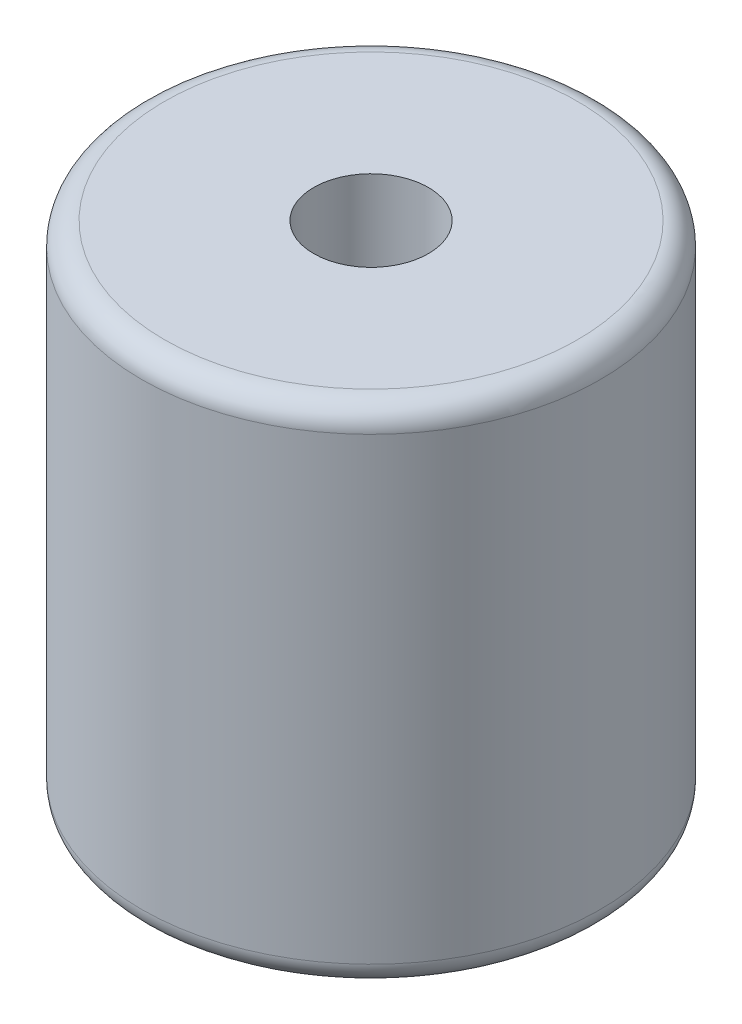
ISO-10303-21;
HEADER;
FILE_DESCRIPTION(('STEP AP214'),'2;1');
FILE_NAME('part.step','',(''),(''),'','','');
FILE_SCHEMA(('AUTOMOTIVE_DESIGN { 1 0 10303 214 1 1 1 1 }'));
ENDSEC;
DATA;
#1=APPLICATION_CONTEXT('core data for automotive mechanical design processes');
#2=APPLICATION_PROTOCOL_DEFINITION('international standard','automotive_design',2000,#1);
#3=PRODUCT_CONTEXT('',#1,'mechanical');
#4=PRODUCT('Part','Part','',(#3));
#5=PRODUCT_RELATED_PRODUCT_CATEGORY('part','',(#4));
#6=PRODUCT_DEFINITION_FORMATION('','',#4);
#7=PRODUCT_DEFINITION_CONTEXT('part definition',#1,'design');
#8=PRODUCT_DEFINITION('design','',#6,#7);
#9=PRODUCT_DEFINITION_SHAPE('','',#8);
#10=(LENGTH_UNIT() NAMED_UNIT(*) SI_UNIT(.MILLI.,.METRE.));
#11=(NAMED_UNIT(*) PLANE_ANGLE_UNIT() SI_UNIT($,.RADIAN.));
#12=(NAMED_UNIT(*) SI_UNIT($,.STERADIAN.) SOLID_ANGLE_UNIT());
#13=UNCERTAINTY_MEASURE_WITH_UNIT(LENGTH_MEASURE(1.E-05),#10,'distance_accuracy_value','');
#14=(GEOMETRIC_REPRESENTATION_CONTEXT(3) GLOBAL_UNCERTAINTY_ASSIGNED_CONTEXT((#13)) GLOBAL_UNIT_ASSIGNED_CONTEXT((#10,
#11,#12)) REPRESENTATION_CONTEXT('',''));
#15=CARTESIAN_POINT('',(0.,0.,0.));
#16=DIRECTION('',(0.,0.,1.));
#17=DIRECTION('',(1.,0.,0.));
#18=AXIS2_PLACEMENT_3D('',#15,#16,#17);
#19=CARTESIAN_POINT('',(0.,-21.,0.));
#20=DIRECTION('',(0.,1.,0.));
#21=DIRECTION('',(0.,0.,1.));
#22=AXIS2_PLACEMENT_3D('',#19,#20,#21);
#23=TOROIDAL_SURFACE('',#22,7.,0.999999999999999);
#24=CARTESIAN_POINT('',(0.,-21.,0.));
#25=DIRECTION('',(0.,1.,0.));
#26=DIRECTION('',(0.,0.,1.));
#27=AXIS2_PLACEMENT_3D('',#24,#25,#26);
#28=CIRCLE('',#27,6.);
#29=CARTESIAN_POINT('',(0.,-21.,6.));
#30=VERTEX_POINT('',#29);
#31=EDGE_CURVE('E10',#30,#30,#28,.T.);
#32=ORIENTED_EDGE('',*,*,#31,.T.);
#33=EDGE_LOOP('',(#32));
#34=FACE_BOUND('',#33,.T.);
#35=CARTESIAN_POINT('',(0.,-22.,0.));
#36=DIRECTION('',(0.,1.,0.));
#37=DIRECTION('',(0.,0.,1.));
#38=AXIS2_PLACEMENT_3D('',#35,#36,#37);
#39=CIRCLE('',#38,7.);
#40=CARTESIAN_POINT('',(0.,-22.,7.));
#41=VERTEX_POINT('',#40);
#42=EDGE_CURVE('E65',#41,#41,#39,.T.);
#43=ORIENTED_EDGE('',*,*,#42,.F.);
#44=EDGE_LOOP('',(#43));
#45=FACE_BOUND('',#44,.T.);
#46=ADVANCED_FACE('F34',(#34,#45),#23,.T.);
#47=CARTESIAN_POINT('',(0.,-22.,0.));
#48=DIRECTION('',(0.,1.,0.));
#49=DIRECTION('',(0.,0.,1.));
#50=AXIS2_PLACEMENT_3D('',#47,#48,#49);
#51=CYLINDRICAL_SURFACE('',#50,6.);
#52=CARTESIAN_POINT('',(0.,-5.,0.));
#53=DIRECTION('',(0.,1.,0.));
#54=DIRECTION('',(0.,0.,1.));
#55=AXIS2_PLACEMENT_3D('',#52,#53,#54);
#56=CIRCLE('',#55,6.);
#57=CARTESIAN_POINT('',(0.,-5.,6.));
#58=VERTEX_POINT('',#57);
#59=EDGE_CURVE('E40',#58,#58,#56,.T.);
#60=ORIENTED_EDGE('',*,*,#59,.T.);
#61=EDGE_LOOP('',(#60));
#62=FACE_BOUND('',#61,.T.);
#63=ORIENTED_EDGE('',*,*,#31,.F.);
#64=EDGE_LOOP('',(#63));
#65=FACE_BOUND('',#64,.T.);
#66=ADVANCED_FACE('F73',(#62,#65),#51,.F.);
#67=CARTESIAN_POINT('',(6.,-5.,0.));
#68=DIRECTION('',(0.,-1.,0.));
#69=DIRECTION('',(0.,0.,-1.));
#70=AXIS2_PLACEMENT_3D('',#67,#68,#69);
#71=PLANE('',#70);
#72=CARTESIAN_POINT('',(0.,-5.,0.));
#73=DIRECTION('',(0.,1.,0.));
#74=DIRECTION('',(0.,0.,1.));
#75=AXIS2_PLACEMENT_3D('',#72,#73,#74);
#76=CIRCLE('',#75,2.5);
#77=CARTESIAN_POINT('',(0.,-5.,2.5));
#78=VERTEX_POINT('',#77);
#79=EDGE_CURVE('E44',#78,#78,#76,.T.);
#80=ORIENTED_EDGE('',*,*,#79,.T.);
#81=EDGE_LOOP('',(#80));
#82=FACE_BOUND('',#81,.T.);
#83=ORIENTED_EDGE('',*,*,#59,.F.);
#84=EDGE_LOOP('',(#83));
#85=FACE_BOUND('',#84,.T.);
#86=ADVANCED_FACE('F77',(#82,#85),#71,.T.);
#87=CARTESIAN_POINT('',(0.,-22.,0.));
#88=DIRECTION('',(0.,1.,0.));
#89=DIRECTION('',(0.,0.,1.));
#90=AXIS2_PLACEMENT_3D('',#87,#88,#89);
#91=CYLINDRICAL_SURFACE('',#90,2.5);
#92=CARTESIAN_POINT('',(0.,0.,0.));
#93=DIRECTION('',(0.,1.,0.));
#94=DIRECTION('',(0.,0.,1.));
#95=AXIS2_PLACEMENT_3D('',#92,#93,#94);
#96=CIRCLE('',#95,2.5);
#97=CARTESIAN_POINT('',(0.,0.,2.5));
#98=VERTEX_POINT('',#97);
#99=EDGE_CURVE('E48',#98,#98,#96,.T.);
#100=ORIENTED_EDGE('',*,*,#99,.T.);
#101=EDGE_LOOP('',(#100));
#102=FACE_BOUND('',#101,.T.);
#103=ORIENTED_EDGE('',*,*,#79,.F.);
#104=EDGE_LOOP('',(#103));
#105=FACE_BOUND('',#104,.T.);
#106=ADVANCED_FACE('F81',(#102,#105),#91,.F.);
#107=CARTESIAN_POINT('',(2.5,0.,0.));
#108=DIRECTION('',(0.,1.,0.));
#109=DIRECTION('',(0.,0.,1.));
#110=AXIS2_PLACEMENT_3D('',#107,#108,#109);
#111=PLANE('',#110);
#112=CARTESIAN_POINT('',(0.,0.,0.));
#113=DIRECTION('',(0.,1.,0.));
#114=DIRECTION('',(0.,0.,1.));
#115=AXIS2_PLACEMENT_3D('',#112,#113,#114);
#116=CIRCLE('',#115,9.);
#117=CARTESIAN_POINT('',(0.,0.,9.));
#118=VERTEX_POINT('',#117);
#119=EDGE_CURVE('E53',#118,#118,#116,.T.);
#120=ORIENTED_EDGE('',*,*,#119,.T.);
#121=EDGE_LOOP('',(#120));
#122=FACE_BOUND('',#121,.T.);
#123=ORIENTED_EDGE('',*,*,#99,.F.);
#124=EDGE_LOOP('',(#123));
#125=FACE_BOUND('',#124,.T.);
#126=ADVANCED_FACE('F88',(#122,#125),#111,.T.);
#127=CARTESIAN_POINT('',(0.,-1.,0.));
#128=DIRECTION('',(0.,1.,0.));
#129=DIRECTION('',(0.,0.,1.));
#130=AXIS2_PLACEMENT_3D('',#127,#128,#129);
#131=TOROIDAL_SURFACE('',#130,9.,1.);
#132=CARTESIAN_POINT('',(0.,-1.,0.));
#133=DIRECTION('',(0.,1.,0.));
#134=DIRECTION('',(0.,0.,1.));
#135=AXIS2_PLACEMENT_3D('',#132,#133,#134);
#136=CIRCLE('',#135,10.);
#137=CARTESIAN_POINT('',(0.,-1.,10.));
#138=VERTEX_POINT('',#137);
#139=EDGE_CURVE('E56',#138,#138,#136,.T.);
#140=ORIENTED_EDGE('',*,*,#139,.T.);
#141=EDGE_LOOP('',(#140));
#142=FACE_BOUND('',#141,.T.);
#143=ORIENTED_EDGE('',*,*,#119,.F.);
#144=EDGE_LOOP('',(#143));
#145=FACE_BOUND('',#144,.T.);
#146=ADVANCED_FACE('F92',(#142,#145),#131,.T.);
#147=CARTESIAN_POINT('',(0.,-22.,0.));
#148=DIRECTION('',(0.,1.,0.));
#149=DIRECTION('',(0.,0.,1.));
#150=AXIS2_PLACEMENT_3D('',#147,#148,#149);
#151=CYLINDRICAL_SURFACE('',#150,10.);
#152=CARTESIAN_POINT('',(0.,-21.,0.));
#153=DIRECTION('',(0.,1.,0.));
#154=DIRECTION('',(0.,0.,1.));
#155=AXIS2_PLACEMENT_3D('',#152,#153,#154);
#156=CIRCLE('',#155,10.);
#157=CARTESIAN_POINT('',(0.,-21.,10.));
#158=VERTEX_POINT('',#157);
#159=EDGE_CURVE('E59',#158,#158,#156,.T.);
#160=ORIENTED_EDGE('',*,*,#159,.T.);
#161=EDGE_LOOP('',(#160));
#162=FACE_BOUND('',#161,.T.);
#163=ORIENTED_EDGE('',*,*,#139,.F.);
#164=EDGE_LOOP('',(#163));
#165=FACE_BOUND('',#164,.T.);
#166=ADVANCED_FACE('F96',(#162,#165),#151,.T.);
#167=CARTESIAN_POINT('',(0.,-21.,0.));
#168=DIRECTION('',(0.,1.,0.));
#169=DIRECTION('',(0.,0.,1.));
#170=AXIS2_PLACEMENT_3D('',#167,#168,#169);
#171=TOROIDAL_SURFACE('',#170,9.,0.999999999999999);
#172=CARTESIAN_POINT('',(0.,-22.,0.));
#173=DIRECTION('',(0.,1.,0.));
#174=DIRECTION('',(0.,0.,1.));
#175=AXIS2_PLACEMENT_3D('',#172,#173,#174);
#176=CIRCLE('',#175,9.);
#177=CARTESIAN_POINT('',(0.,-22.,9.));
#178=VERTEX_POINT('',#177);
#179=EDGE_CURVE('E62',#178,#178,#176,.T.);
#180=ORIENTED_EDGE('',*,*,#179,.T.);
#181=EDGE_LOOP('',(#180));
#182=FACE_BOUND('',#181,.T.);
#183=ORIENTED_EDGE('',*,*,#159,.F.);
#184=EDGE_LOOP('',(#183));
#185=FACE_BOUND('',#184,.T.);
#186=ADVANCED_FACE('F100',(#182,#185),#171,.T.);
#187=CARTESIAN_POINT('',(9.,-22.,0.));
#188=DIRECTION('',(0.,-1.,0.));
#189=DIRECTION('',(0.,0.,-1.));
#190=AXIS2_PLACEMENT_3D('',#187,#188,#189);
#191=PLANE('',#190);
#192=ORIENTED_EDGE('',*,*,#42,.T.);
#193=EDGE_LOOP('',(#192));
#194=FACE_BOUND('',#193,.T.);
#195=ORIENTED_EDGE('',*,*,#179,.F.);
#196=EDGE_LOOP('',(#195));
#197=FACE_BOUND('',#196,.T.);
#198=ADVANCED_FACE('F69',(#194,#197),#191,.T.);
#199=CLOSED_SHELL('',(#46,#66,#86,#106,#126,#146,#166,#186,#198));
#200=MANIFOLD_SOLID_BREP('B2',#199);
#201=ADVANCED_BREP_SHAPE_REPRESENTATION('',(#18,#200),#14);
#202=SHAPE_DEFINITION_REPRESENTATION(#9,#201);
ENDSEC;
END-ISO-10303-21;
